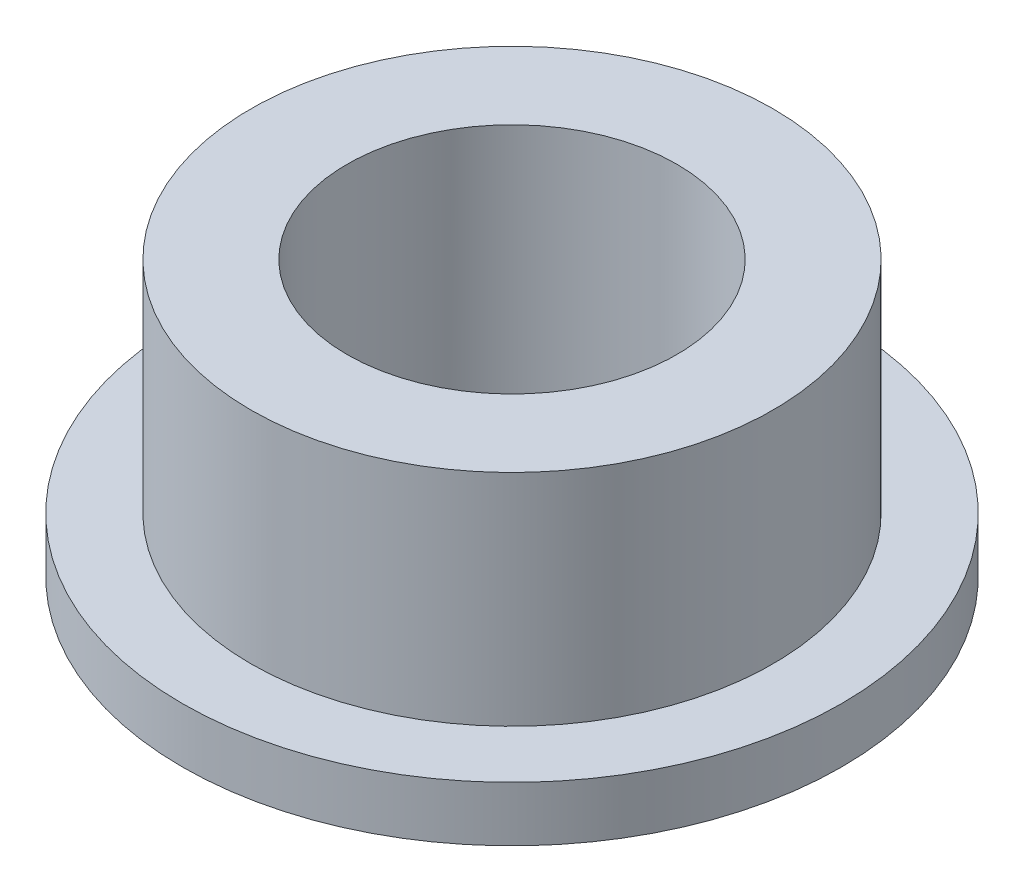
ISO-10303-21;
HEADER;
FILE_DESCRIPTION(('STEP AP214'),'2;1');
FILE_NAME('part.step','',(''),(''),'','','');
FILE_SCHEMA(('AUTOMOTIVE_DESIGN { 1 0 10303 214 1 1 1 1 }'));
ENDSEC;
DATA;
#1=APPLICATION_CONTEXT('core data for automotive mechanical design processes');
#2=APPLICATION_PROTOCOL_DEFINITION('international standard','automotive_design',2000,#1);
#3=PRODUCT_CONTEXT('',#1,'mechanical');
#4=PRODUCT('Part','Part','',(#3));
#5=PRODUCT_RELATED_PRODUCT_CATEGORY('part','',(#4));
#6=PRODUCT_DEFINITION_FORMATION('','',#4);
#7=PRODUCT_DEFINITION_CONTEXT('part definition',#1,'design');
#8=PRODUCT_DEFINITION('design','',#6,#7);
#9=PRODUCT_DEFINITION_SHAPE('','',#8);
#10=(LENGTH_UNIT() NAMED_UNIT(*) SI_UNIT(.MILLI.,.METRE.));
#11=(NAMED_UNIT(*) PLANE_ANGLE_UNIT() SI_UNIT($,.RADIAN.));
#12=(NAMED_UNIT(*) SI_UNIT($,.STERADIAN.) SOLID_ANGLE_UNIT());
#13=UNCERTAINTY_MEASURE_WITH_UNIT(LENGTH_MEASURE(1.E-05),#10,'distance_accuracy_value','');
#14=(GEOMETRIC_REPRESENTATION_CONTEXT(3) GLOBAL_UNCERTAINTY_ASSIGNED_CONTEXT((#13)) GLOBAL_UNIT_ASSIGNED_CONTEXT((#10,
#11,#12)) REPRESENTATION_CONTEXT('',''));
#15=CARTESIAN_POINT('',(0.,0.,0.));
#16=DIRECTION('',(0.,0.,1.));
#17=DIRECTION('',(1.,0.,0.));
#18=AXIS2_PLACEMENT_3D('',#15,#16,#17);
#19=CARTESIAN_POINT('',(0.,5.41544571321385,0.));
#20=DIRECTION('',(0.,1.,0.));
#21=DIRECTION('',(0.,0.,1.));
#22=AXIS2_PLACEMENT_3D('',#19,#20,#21);
#23=PLANE('',#22);
#24=CARTESIAN_POINT('',(0.,5.41544571321385,0.));
#25=DIRECTION('',(0.,1.,0.));
#26=DIRECTION('',(0.,0.,1.));
#27=AXIS2_PLACEMENT_3D('',#24,#25,#26);
#28=CIRCLE('',#27,7.125);
#29=CARTESIAN_POINT('',(0.,5.41544571321385,7.125));
#30=VERTEX_POINT('',#29);
#31=EDGE_CURVE('E10',#30,#30,#28,.T.);
#32=ORIENTED_EDGE('',*,*,#31,.T.);
#33=EDGE_LOOP('',(#32));
#34=FACE_BOUND('',#33,.T.);
#35=CARTESIAN_POINT('',(0.,5.41544571321385,0.));
#36=DIRECTION('',(0.,1.,0.));
#37=DIRECTION('',(0.,0.,1.));
#38=AXIS2_PLACEMENT_3D('',#35,#36,#37);
#39=CIRCLE('',#38,4.5015);
#40=CARTESIAN_POINT('',(0.,5.41544571321385,4.5015));
#41=VERTEX_POINT('',#40);
#42=EDGE_CURVE('E45',#41,#41,#39,.T.);
#43=ORIENTED_EDGE('',*,*,#42,.F.);
#44=EDGE_LOOP('',(#43));
#45=FACE_BOUND('',#44,.T.);
#46=ADVANCED_FACE('F36',(#34,#45),#23,.T.);
#47=CARTESIAN_POINT('',(0.,5.41544571321385,0.));
#48=DIRECTION('',(0.,-1.,0.));
#49=DIRECTION('',(0.,0.,-1.));
#50=AXIS2_PLACEMENT_3D('',#47,#48,#49);
#51=CYLINDRICAL_SURFACE('',#50,7.125);
#52=ORIENTED_EDGE('',*,*,#31,.F.);
#53=EDGE_LOOP('',(#52));
#54=FACE_BOUND('',#53,.T.);
#55=CARTESIAN_POINT('',(0.,-0.584554286786154,0.));
#56=DIRECTION('',(0.,1.,0.));
#57=DIRECTION('',(0.,0.,1.));
#58=AXIS2_PLACEMENT_3D('',#55,#56,#57);
#59=CIRCLE('',#58,7.125);
#60=CARTESIAN_POINT('',(0.,-0.584554286786154,7.125));
#61=VERTEX_POINT('',#60);
#62=EDGE_CURVE('E40',#61,#61,#59,.T.);
#63=ORIENTED_EDGE('',*,*,#62,.T.);
#64=EDGE_LOOP('',(#63));
#65=FACE_BOUND('',#64,.T.);
#66=ADVANCED_FACE('F38',(#54,#65),#51,.T.);
#67=CARTESIAN_POINT('',(0.,5.41544571321385,0.));
#68=DIRECTION('',(0.,-1.,0.));
#69=DIRECTION('',(0.,0.,-1.));
#70=AXIS2_PLACEMENT_3D('',#67,#68,#69);
#71=CYLINDRICAL_SURFACE('',#70,4.5015);
#72=ORIENTED_EDGE('',*,*,#42,.T.);
#73=EDGE_LOOP('',(#72));
#74=FACE_BOUND('',#73,.T.);
#75=CARTESIAN_POINT('',(0.,-2.08455428678615,0.));
#76=DIRECTION('',(0.,-1.,0.));
#77=DIRECTION('',(0.,0.,-1.));
#78=AXIS2_PLACEMENT_3D('',#75,#76,#77);
#79=CIRCLE('',#78,4.5015);
#80=CARTESIAN_POINT('',(0.,-2.08455428678615,-4.5015));
#81=VERTEX_POINT('',#80);
#82=EDGE_CURVE('E57',#81,#81,#79,.T.);
#83=ORIENTED_EDGE('',*,*,#82,.T.);
#84=EDGE_LOOP('',(#83));
#85=FACE_BOUND('',#84,.T.);
#86=ADVANCED_FACE('F65',(#74,#85),#71,.F.);
#87=CARTESIAN_POINT('',(0.,-2.08455428678615,0.));
#88=DIRECTION('',(0.,-1.,0.));
#89=DIRECTION('',(0.,0.,-1.));
#90=AXIS2_PLACEMENT_3D('',#87,#88,#89);
#91=PLANE('',#90);
#92=CARTESIAN_POINT('',(0.,-2.08455428678615,0.));
#93=DIRECTION('',(0.,-1.,0.));
#94=DIRECTION('',(0.,0.,-1.));
#95=AXIS2_PLACEMENT_3D('',#92,#93,#94);
#96=CIRCLE('',#95,9.);
#97=CARTESIAN_POINT('',(0.,-2.08455428678615,-9.));
#98=VERTEX_POINT('',#97);
#99=EDGE_CURVE('E56',#98,#98,#96,.T.);
#100=ORIENTED_EDGE('',*,*,#99,.T.);
#101=EDGE_LOOP('',(#100));
#102=FACE_BOUND('',#101,.T.);
#103=ORIENTED_EDGE('',*,*,#82,.F.);
#104=EDGE_LOOP('',(#103));
#105=FACE_BOUND('',#104,.T.);
#106=ADVANCED_FACE('F67',(#102,#105),#91,.T.);
#107=CARTESIAN_POINT('',(0.,-0.584554286786154,0.));
#108=DIRECTION('',(0.,-1.,0.));
#109=DIRECTION('',(0.,0.,-1.));
#110=AXIS2_PLACEMENT_3D('',#107,#108,#109);
#111=PLANE('',#110);
#112=ORIENTED_EDGE('',*,*,#62,.F.);
#113=EDGE_LOOP('',(#112));
#114=FACE_BOUND('',#113,.T.);
#115=CARTESIAN_POINT('',(0.,-0.584554286786154,0.));
#116=DIRECTION('',(0.,-1.,0.));
#117=DIRECTION('',(0.,0.,-1.));
#118=AXIS2_PLACEMENT_3D('',#115,#116,#117);
#119=CIRCLE('',#118,9.);
#120=CARTESIAN_POINT('',(0.,-0.584554286786154,-9.));
#121=VERTEX_POINT('',#120);
#122=EDGE_CURVE('E52',#121,#121,#119,.T.);
#123=ORIENTED_EDGE('',*,*,#122,.F.);
#124=EDGE_LOOP('',(#123));
#125=FACE_BOUND('',#124,.T.);
#126=ADVANCED_FACE('F69',(#114,#125),#111,.F.);
#127=CARTESIAN_POINT('',(0.,-2.08455428678615,0.));
#128=DIRECTION('',(0.,1.,0.));
#129=DIRECTION('',(0.,0.,1.));
#130=AXIS2_PLACEMENT_3D('',#127,#128,#129);
#131=CYLINDRICAL_SURFACE('',#130,9.);
#132=ORIENTED_EDGE('',*,*,#99,.F.);
#133=EDGE_LOOP('',(#132));
#134=FACE_BOUND('',#133,.T.);
#135=ORIENTED_EDGE('',*,*,#122,.T.);
#136=EDGE_LOOP('',(#135));
#137=FACE_BOUND('',#136,.T.);
#138=ADVANCED_FACE('F76',(#134,#137),#131,.T.);
#139=CLOSED_SHELL('',(#46,#66,#86,#106,#126,#138));
#140=MANIFOLD_SOLID_BREP('B2',#139);
#141=ADVANCED_BREP_SHAPE_REPRESENTATION('',(#18,#140),#14);
#142=SHAPE_DEFINITION_REPRESENTATION(#9,#141);
ENDSEC;
END-ISO-10303-21;
